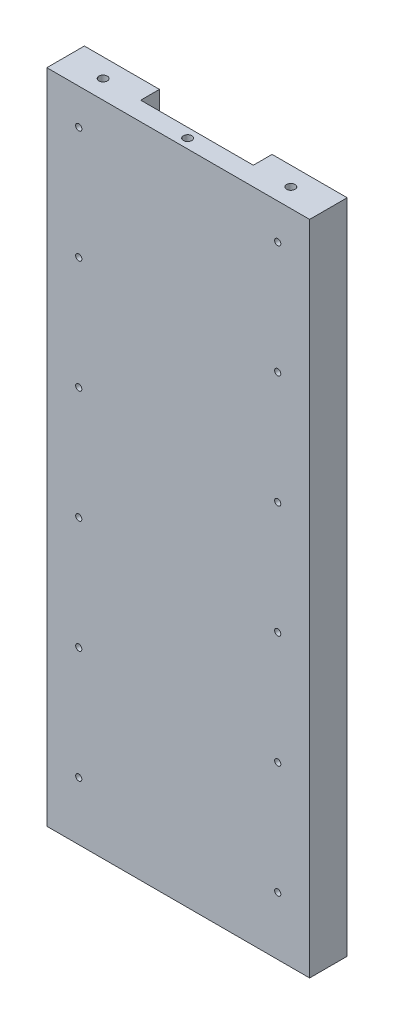
ISO-10303-21;
HEADER;
FILE_DESCRIPTION(('STEP AP214'),'2;1');
FILE_NAME('part.step','',(''),(''),'','','');
FILE_SCHEMA(('AUTOMOTIVE_DESIGN { 1 0 10303 214 1 1 1 1 }'));
ENDSEC;
DATA;
#1=APPLICATION_CONTEXT('core data for automotive mechanical design processes');
#2=APPLICATION_PROTOCOL_DEFINITION('international standard','automotive_design',2000,#1);
#3=PRODUCT_CONTEXT('',#1,'mechanical');
#4=PRODUCT('Part','Part','',(#3));
#5=PRODUCT_RELATED_PRODUCT_CATEGORY('part','',(#4));
#6=PRODUCT_DEFINITION_FORMATION('','',#4);
#7=PRODUCT_DEFINITION_CONTEXT('part definition',#1,'design');
#8=PRODUCT_DEFINITION('design','',#6,#7);
#9=PRODUCT_DEFINITION_SHAPE('','',#8);
#10=(LENGTH_UNIT() NAMED_UNIT(*) SI_UNIT(.MILLI.,.METRE.));
#11=(NAMED_UNIT(*) PLANE_ANGLE_UNIT() SI_UNIT($,.RADIAN.));
#12=(NAMED_UNIT(*) SI_UNIT($,.STERADIAN.) SOLID_ANGLE_UNIT());
#13=UNCERTAINTY_MEASURE_WITH_UNIT(LENGTH_MEASURE(1.E-05),#10,'distance_accuracy_value','');
#14=(GEOMETRIC_REPRESENTATION_CONTEXT(3) GLOBAL_UNCERTAINTY_ASSIGNED_CONTEXT((#13)) GLOBAL_UNIT_ASSIGNED_CONTEXT((#10,
#11,#12)) REPRESENTATION_CONTEXT('',''));
#15=CARTESIAN_POINT('',(0.,0.,0.));
#16=DIRECTION('',(0.,0.,1.));
#17=DIRECTION('',(1.,0.,0.));
#18=AXIS2_PLACEMENT_3D('',#15,#16,#17);
#19=CARTESIAN_POINT('',(0.,350.,0.));
#20=DIRECTION('',(0.,0.,-1.));
#21=DIRECTION('',(-1.,0.,0.));
#22=AXIS2_PLACEMENT_3D('',#19,#20,#21);
#23=PLANE('',#22);
#24=CARTESIAN_POINT('',(17.,91.,0.));
#25=DIRECTION('',(0.,0.,-1.));
#26=DIRECTION('',(-1.,0.,0.));
#27=AXIS2_PLACEMENT_3D('',#24,#25,#26);
#28=CIRCLE('',#27,1.65);
#29=CARTESIAN_POINT('',(15.35,91.,0.));
#30=VERTEX_POINT('',#29);
#31=EDGE_CURVE('E246',#30,#30,#28,.T.);
#32=ORIENTED_EDGE('',*,*,#31,.F.);
#33=EDGE_LOOP('',(#32));
#34=FACE_BOUND('',#33,.T.);
#35=CARTESIAN_POINT('',(17.,151.,0.));
#36=DIRECTION('',(0.,0.,-1.));
#37=DIRECTION('',(-1.,0.,0.));
#38=AXIS2_PLACEMENT_3D('',#35,#36,#37);
#39=CIRCLE('',#38,1.65);
#40=CARTESIAN_POINT('',(15.35,151.,0.));
#41=VERTEX_POINT('',#40);
#42=EDGE_CURVE('E240',#41,#41,#39,.T.);
#43=ORIENTED_EDGE('',*,*,#42,.F.);
#44=EDGE_LOOP('',(#43));
#45=FACE_BOUND('',#44,.T.);
#46=CARTESIAN_POINT('',(17.,211.,0.));
#47=DIRECTION('',(0.,0.,-1.));
#48=DIRECTION('',(-1.,0.,0.));
#49=AXIS2_PLACEMENT_3D('',#46,#47,#48);
#50=CIRCLE('',#49,1.65);
#51=CARTESIAN_POINT('',(15.35,211.,0.));
#52=VERTEX_POINT('',#51);
#53=EDGE_CURVE('E234',#52,#52,#50,.T.);
#54=ORIENTED_EDGE('',*,*,#53,.F.);
#55=EDGE_LOOP('',(#54));
#56=FACE_BOUND('',#55,.T.);
#57=CARTESIAN_POINT('',(17.,271.,0.));
#58=DIRECTION('',(0.,0.,-1.));
#59=DIRECTION('',(-1.,0.,0.));
#60=AXIS2_PLACEMENT_3D('',#57,#58,#59);
#61=CIRCLE('',#60,1.65);
#62=CARTESIAN_POINT('',(15.35,271.,0.));
#63=VERTEX_POINT('',#62);
#64=EDGE_CURVE('E228',#63,#63,#61,.T.);
#65=ORIENTED_EDGE('',*,*,#64,.F.);
#66=EDGE_LOOP('',(#65));
#67=FACE_BOUND('',#66,.T.);
#68=CARTESIAN_POINT('',(17.,31.,0.));
#69=DIRECTION('',(0.,0.,-1.));
#70=DIRECTION('',(-1.,0.,0.));
#71=AXIS2_PLACEMENT_3D('',#68,#69,#70);
#72=CIRCLE('',#71,1.65);
#73=CARTESIAN_POINT('',(15.35,31.,0.));
#74=VERTEX_POINT('',#73);
#75=EDGE_CURVE('E216',#74,#74,#72,.T.);
#76=ORIENTED_EDGE('',*,*,#75,.F.);
#77=EDGE_LOOP('',(#76));
#78=FACE_BOUND('',#77,.T.);
#79=CARTESIAN_POINT('',(17.,331.,0.));
#80=DIRECTION('',(0.,0.,-1.));
#81=DIRECTION('',(-1.,0.,0.));
#82=AXIS2_PLACEMENT_3D('',#79,#80,#81);
#83=CIRCLE('',#82,1.65000000000001);
#84=CARTESIAN_POINT('',(15.35,331.,0.));
#85=VERTEX_POINT('',#84);
#86=EDGE_CURVE('E210',#85,#85,#83,.T.);
#87=ORIENTED_EDGE('',*,*,#86,.F.);
#88=EDGE_LOOP('',(#87));
#89=FACE_BOUND('',#88,.T.);
#90=DIRECTION('',(0.,1.,0.));
#91=VECTOR('',#90,1.);
#92=CARTESIAN_POINT('',(40.,350.,0.));
#93=LINE('',#92,#91);
#94=CARTESIAN_POINT('',(40.,0.,0.));
#95=VERTEX_POINT('',#94);
#96=CARTESIAN_POINT('',(40.,350.,0.));
#97=VERTEX_POINT('',#96);
#98=EDGE_CURVE('E101',#95,#97,#93,.T.);
#99=ORIENTED_EDGE('',*,*,#98,.F.);
#100=DIRECTION('',(1.,0.,0.));
#101=VECTOR('',#100,1.);
#102=CARTESIAN_POINT('',(0.,0.,0.));
#103=LINE('',#102,#101);
#104=CARTESIAN_POINT('',(0.,0.,0.));
#105=VERTEX_POINT('',#104);
#106=EDGE_CURVE('E119',#105,#95,#103,.T.);
#107=ORIENTED_EDGE('',*,*,#106,.F.);
#108=DIRECTION('',(0.,-1.,0.));
#109=VECTOR('',#108,1.);
#110=CARTESIAN_POINT('',(0.,0.,0.));
#111=LINE('',#110,#109);
#112=CARTESIAN_POINT('',(0.,350.,0.));
#113=VERTEX_POINT('',#112);
#114=EDGE_CURVE('E120',#113,#105,#111,.T.);
#115=ORIENTED_EDGE('',*,*,#114,.F.);
#116=DIRECTION('',(-1.,0.,0.));
#117=VECTOR('',#116,1.);
#118=CARTESIAN_POINT('',(0.,350.,0.));
#119=LINE('',#118,#117);
#120=EDGE_CURVE('E128',#97,#113,#119,.T.);
#121=ORIENTED_EDGE('',*,*,#120,.F.);
#122=EDGE_LOOP('',(#99,#107,#115,#121));
#123=FACE_BOUND('',#122,.T.);
#124=ADVANCED_FACE('F29',(#34,#45,#56,#67,#78,#89,#123),#23,.T.);
#125=CARTESIAN_POINT('',(0.,0.,20.));
#126=DIRECTION('',(1.,0.,0.));
#127=DIRECTION('',(0.,0.,-1.));
#128=AXIS2_PLACEMENT_3D('',#125,#126,#127);
#129=PLANE('',#128);
#130=ORIENTED_EDGE('',*,*,#114,.T.);
#131=DIRECTION('',(0.,0.,-1.));
#132=VECTOR('',#131,1.);
#133=CARTESIAN_POINT('',(0.,0.,20.));
#134=LINE('',#133,#132);
#135=CARTESIAN_POINT('',(0.,0.,20.));
#136=VERTEX_POINT('',#135);
#137=EDGE_CURVE('E11',#136,#105,#134,.T.);
#138=ORIENTED_EDGE('',*,*,#137,.F.);
#139=DIRECTION('',(0.,-1.,0.));
#140=VECTOR('',#139,1.);
#141=CARTESIAN_POINT('',(0.,0.,20.));
#142=LINE('',#141,#140);
#143=CARTESIAN_POINT('',(0.,350.,20.));
#144=VERTEX_POINT('',#143);
#145=EDGE_CURVE('E131',#144,#136,#142,.T.);
#146=ORIENTED_EDGE('',*,*,#145,.F.);
#147=DIRECTION('',(0.,0.,-1.));
#148=VECTOR('',#147,1.);
#149=CARTESIAN_POINT('',(0.,350.,20.));
#150=LINE('',#149,#148);
#151=EDGE_CURVE('E138',#144,#113,#150,.T.);
#152=ORIENTED_EDGE('',*,*,#151,.T.);
#153=EDGE_LOOP('',(#130,#138,#146,#152));
#154=FACE_BOUND('',#153,.T.);
#155=ADVANCED_FACE('F31',(#154),#129,.F.);
#156=CARTESIAN_POINT('',(0.,0.,20.));
#157=DIRECTION('',(0.,1.,0.));
#158=DIRECTION('',(0.,0.,1.));
#159=AXIS2_PLACEMENT_3D('',#156,#157,#158);
#160=PLANE('',#159);
#161=CARTESIAN_POINT('',(120.,0.,10.));
#162=DIRECTION('',(0.,-1.,0.));
#163=DIRECTION('',(0.,0.,-1.));
#164=AXIS2_PLACEMENT_3D('',#161,#162,#163);
#165=CIRCLE('',#164,2.25);
#166=CARTESIAN_POINT('',(120.,0.,7.75000000000001));
#167=VERTEX_POINT('',#166);
#168=EDGE_CURVE('E198',#167,#167,#165,.T.);
#169=ORIENTED_EDGE('',*,*,#168,.F.);
#170=EDGE_LOOP('',(#169));
#171=FACE_BOUND('',#170,.T.);
#172=CARTESIAN_POINT('',(20.,0.,9.99999999999999));
#173=DIRECTION('',(0.,-1.,0.));
#174=DIRECTION('',(0.,0.,-1.));
#175=AXIS2_PLACEMENT_3D('',#172,#173,#174);
#176=CIRCLE('',#175,2.25);
#177=CARTESIAN_POINT('',(20.,0.,7.74999999999999));
#178=VERTEX_POINT('',#177);
#179=EDGE_CURVE('E192',#178,#178,#176,.T.);
#180=ORIENTED_EDGE('',*,*,#179,.F.);
#181=EDGE_LOOP('',(#180));
#182=FACE_BOUND('',#181,.T.);
#183=ORIENTED_EDGE('',*,*,#106,.T.);
#184=DIRECTION('',(0.,0.,-1.));
#185=VECTOR('',#184,1.);
#186=CARTESIAN_POINT('',(40.,0.,10.));
#187=LINE('',#186,#185);
#188=CARTESIAN_POINT('',(40.,0.,10.));
#189=VERTEX_POINT('',#188);
#190=EDGE_CURVE('E114',#189,#95,#187,.T.);
#191=ORIENTED_EDGE('',*,*,#190,.F.);
#192=DIRECTION('',(-1.,0.,0.));
#193=VECTOR('',#192,1.);
#194=CARTESIAN_POINT('',(40.,0.,10.));
#195=LINE('',#194,#193);
#196=CARTESIAN_POINT('',(100.,0.,10.));
#197=VERTEX_POINT('',#196);
#198=EDGE_CURVE('E113',#197,#189,#195,.T.);
#199=ORIENTED_EDGE('',*,*,#198,.F.);
#200=DIRECTION('',(0.,0.,-1.));
#201=VECTOR('',#200,1.);
#202=CARTESIAN_POINT('',(100.,0.,10.));
#203=LINE('',#202,#201);
#204=CARTESIAN_POINT('',(100.,0.,0.));
#205=VERTEX_POINT('',#204);
#206=EDGE_CURVE('E95',#197,#205,#203,.T.);
#207=ORIENTED_EDGE('',*,*,#206,.T.);
#208=CARTESIAN_POINT('',(140.,0.,0.));
#209=VERTEX_POINT('',#208);
#210=EDGE_CURVE('E109',#205,#209,#103,.T.);
#211=ORIENTED_EDGE('',*,*,#210,.T.);
#212=DIRECTION('',(0.,0.,-1.));
#213=VECTOR('',#212,1.);
#214=CARTESIAN_POINT('',(140.,0.,20.));
#215=LINE('',#214,#213);
#216=CARTESIAN_POINT('',(140.,0.,20.));
#217=VERTEX_POINT('',#216);
#218=EDGE_CURVE('E37',#217,#209,#215,.T.);
#219=ORIENTED_EDGE('',*,*,#218,.F.);
#220=DIRECTION('',(1.,0.,0.));
#221=VECTOR('',#220,1.);
#222=CARTESIAN_POINT('',(0.,0.,20.));
#223=LINE('',#222,#221);
#224=EDGE_CURVE('E133',#136,#217,#223,.T.);
#225=ORIENTED_EDGE('',*,*,#224,.F.);
#226=ORIENTED_EDGE('',*,*,#137,.T.);
#227=EDGE_LOOP('',(#183,#191,#199,#207,#211,#219,#225,#226));
#228=FACE_BOUND('',#227,.T.);
#229=ADVANCED_FACE('F107',(#171,#182,#228),#160,.F.);
#230=CARTESIAN_POINT('',(140.,0.,20.));
#231=DIRECTION('',(-1.,0.,0.));
#232=DIRECTION('',(0.,0.,1.));
#233=AXIS2_PLACEMENT_3D('',#230,#231,#232);
#234=PLANE('',#233);
#235=DIRECTION('',(0.,1.,0.));
#236=VECTOR('',#235,1.);
#237=CARTESIAN_POINT('',(140.,0.,0.));
#238=LINE('',#237,#236);
#239=CARTESIAN_POINT('',(140.,350.,0.));
#240=VERTEX_POINT('',#239);
#241=EDGE_CURVE('E118',#209,#240,#238,.T.);
#242=ORIENTED_EDGE('',*,*,#241,.T.);
#243=DIRECTION('',(0.,0.,-1.));
#244=VECTOR('',#243,1.);
#245=CARTESIAN_POINT('',(140.,350.,20.));
#246=LINE('',#245,#244);
#247=CARTESIAN_POINT('',(140.,350.,20.));
#248=VERTEX_POINT('',#247);
#249=EDGE_CURVE('E141',#248,#240,#246,.T.);
#250=ORIENTED_EDGE('',*,*,#249,.F.);
#251=DIRECTION('',(0.,1.,0.));
#252=VECTOR('',#251,1.);
#253=CARTESIAN_POINT('',(140.,0.,20.));
#254=LINE('',#253,#252);
#255=EDGE_CURVE('E135',#217,#248,#254,.T.);
#256=ORIENTED_EDGE('',*,*,#255,.F.);
#257=ORIENTED_EDGE('',*,*,#218,.T.);
#258=EDGE_LOOP('',(#242,#250,#256,#257));
#259=FACE_BOUND('',#258,.T.);
#260=ADVANCED_FACE('F145',(#259),#234,.F.);
#261=CARTESIAN_POINT('',(0.,350.,20.));
#262=DIRECTION('',(0.,-1.,0.));
#263=DIRECTION('',(0.,0.,-1.));
#264=AXIS2_PLACEMENT_3D('',#261,#262,#263);
#265=PLANE('',#264);
#266=CARTESIAN_POINT('',(120.,350.,9.99999999999999));
#267=DIRECTION('',(0.,1.,0.));
#268=DIRECTION('',(0.,0.,1.));
#269=AXIS2_PLACEMENT_3D('',#266,#267,#268);
#270=CIRCLE('',#269,2.25);
#271=CARTESIAN_POINT('',(120.,350.,12.25));
#272=VERTEX_POINT('',#271);
#273=EDGE_CURVE('E186',#272,#272,#270,.T.);
#274=ORIENTED_EDGE('',*,*,#273,.F.);
#275=EDGE_LOOP('',(#274));
#276=FACE_BOUND('',#275,.T.);
#277=CARTESIAN_POINT('',(70.,350.,15.0000000000075));
#278=DIRECTION('',(0.,1.,0.));
#279=DIRECTION('',(0.,0.,1.));
#280=AXIS2_PLACEMENT_3D('',#277,#278,#279);
#281=CIRCLE('',#280,2.25);
#282=CARTESIAN_POINT('',(70.,350.,17.2500000000074));
#283=VERTEX_POINT('',#282);
#284=EDGE_CURVE('E180',#283,#283,#281,.T.);
#285=ORIENTED_EDGE('',*,*,#284,.F.);
#286=EDGE_LOOP('',(#285));
#287=FACE_BOUND('',#286,.T.);
#288=CARTESIAN_POINT('',(20.,350.,10.));
#289=DIRECTION('',(0.,1.,0.));
#290=DIRECTION('',(0.,0.,1.));
#291=AXIS2_PLACEMENT_3D('',#288,#289,#290);
#292=CIRCLE('',#291,2.25);
#293=CARTESIAN_POINT('',(20.,350.,12.25));
#294=VERTEX_POINT('',#293);
#295=EDGE_CURVE('E174',#294,#294,#292,.T.);
#296=ORIENTED_EDGE('',*,*,#295,.F.);
#297=EDGE_LOOP('',(#296));
#298=FACE_BOUND('',#297,.T.);
#299=DIRECTION('',(1.,0.,0.));
#300=VECTOR('',#299,1.);
#301=CARTESIAN_POINT('',(100.,350.,10.));
#302=LINE('',#301,#300);
#303=CARTESIAN_POINT('',(40.,350.,10.));
#304=VERTEX_POINT('',#303);
#305=CARTESIAN_POINT('',(100.,350.,10.));
#306=VERTEX_POINT('',#305);
#307=EDGE_CURVE('E169',#304,#306,#302,.T.);
#308=ORIENTED_EDGE('',*,*,#307,.F.);
#309=DIRECTION('',(0.,0.,-1.));
#310=VECTOR('',#309,1.);
#311=CARTESIAN_POINT('',(40.,350.,10.));
#312=LINE('',#311,#310);
#313=EDGE_CURVE('E123',#304,#97,#312,.T.);
#314=ORIENTED_EDGE('',*,*,#313,.T.);
#315=ORIENTED_EDGE('',*,*,#120,.T.);
#316=ORIENTED_EDGE('',*,*,#151,.F.);
#317=DIRECTION('',(-1.,0.,0.));
#318=VECTOR('',#317,1.);
#319=CARTESIAN_POINT('',(0.,350.,20.));
#320=LINE('',#319,#318);
#321=EDGE_CURVE('E52',#248,#144,#320,.T.);
#322=ORIENTED_EDGE('',*,*,#321,.F.);
#323=ORIENTED_EDGE('',*,*,#249,.T.);
#324=CARTESIAN_POINT('',(100.,350.,0.));
#325=VERTEX_POINT('',#324);
#326=EDGE_CURVE('E129',#240,#325,#119,.T.);
#327=ORIENTED_EDGE('',*,*,#326,.T.);
#328=DIRECTION('',(0.,0.,-1.));
#329=VECTOR('',#328,1.);
#330=CARTESIAN_POINT('',(100.,350.,10.));
#331=LINE('',#330,#329);
#332=EDGE_CURVE('E44',#306,#325,#331,.T.);
#333=ORIENTED_EDGE('',*,*,#332,.F.);
#334=EDGE_LOOP('',(#308,#314,#315,#316,#322,#323,#327,#333));
#335=FACE_BOUND('',#334,.T.);
#336=ADVANCED_FACE('F319',(#276,#287,#298,#335),#265,.F.);
#337=CARTESIAN_POINT('',(0.,350.,20.));
#338=DIRECTION('',(0.,0.,-1.));
#339=DIRECTION('',(-1.,0.,0.));
#340=AXIS2_PLACEMENT_3D('',#337,#338,#339);
#341=PLANE('',#340);
#342=CARTESIAN_POINT('',(123.,271.,20.));
#343=DIRECTION('',(0.,0.,-1.));
#344=DIRECTION('',(-1.,0.,0.));
#345=AXIS2_PLACEMENT_3D('',#342,#343,#344);
#346=CIRCLE('',#345,1.65000000000001);
#347=CARTESIAN_POINT('',(121.35,271.,20.));
#348=VERTEX_POINT('',#347);
#349=EDGE_CURVE('E267',#348,#348,#346,.T.);
#350=ORIENTED_EDGE('',*,*,#349,.T.);
#351=EDGE_LOOP('',(#350));
#352=FACE_BOUND('',#351,.T.);
#353=CARTESIAN_POINT('',(123.,211.,20.));
#354=DIRECTION('',(0.,0.,-1.));
#355=DIRECTION('',(-1.,0.,0.));
#356=AXIS2_PLACEMENT_3D('',#353,#354,#355);
#357=CIRCLE('',#356,1.65000000000001);
#358=CARTESIAN_POINT('',(121.35,211.,20.));
#359=VERTEX_POINT('',#358);
#360=EDGE_CURVE('E261',#359,#359,#357,.T.);
#361=ORIENTED_EDGE('',*,*,#360,.T.);
#362=EDGE_LOOP('',(#361));
#363=FACE_BOUND('',#362,.T.);
#364=CARTESIAN_POINT('',(123.,151.,20.));
#365=DIRECTION('',(0.,0.,-1.));
#366=DIRECTION('',(-1.,0.,0.));
#367=AXIS2_PLACEMENT_3D('',#364,#365,#366);
#368=CIRCLE('',#367,1.65000000000001);
#369=CARTESIAN_POINT('',(121.35,151.,20.));
#370=VERTEX_POINT('',#369);
#371=EDGE_CURVE('E255',#370,#370,#368,.T.);
#372=ORIENTED_EDGE('',*,*,#371,.T.);
#373=EDGE_LOOP('',(#372));
#374=FACE_BOUND('',#373,.T.);
#375=CARTESIAN_POINT('',(123.,91.,20.));
#376=DIRECTION('',(0.,0.,-1.));
#377=DIRECTION('',(-1.,0.,0.));
#378=AXIS2_PLACEMENT_3D('',#375,#376,#377);
#379=CIRCLE('',#378,1.65);
#380=CARTESIAN_POINT('',(121.35,91.,20.));
#381=VERTEX_POINT('',#380);
#382=EDGE_CURVE('E249',#381,#381,#379,.T.);
#383=ORIENTED_EDGE('',*,*,#382,.T.);
#384=EDGE_LOOP('',(#383));
#385=FACE_BOUND('',#384,.T.);
#386=CARTESIAN_POINT('',(17.,91.,20.));
#387=DIRECTION('',(0.,0.,-1.));
#388=DIRECTION('',(-1.,0.,0.));
#389=AXIS2_PLACEMENT_3D('',#386,#387,#388);
#390=CIRCLE('',#389,1.65);
#391=CARTESIAN_POINT('',(15.35,91.,20.));
#392=VERTEX_POINT('',#391);
#393=EDGE_CURVE('E243',#392,#392,#390,.T.);
#394=ORIENTED_EDGE('',*,*,#393,.T.);
#395=EDGE_LOOP('',(#394));
#396=FACE_BOUND('',#395,.T.);
#397=CARTESIAN_POINT('',(17.,151.,20.));
#398=DIRECTION('',(0.,0.,-1.));
#399=DIRECTION('',(-1.,0.,0.));
#400=AXIS2_PLACEMENT_3D('',#397,#398,#399);
#401=CIRCLE('',#400,1.65);
#402=CARTESIAN_POINT('',(15.35,151.,20.));
#403=VERTEX_POINT('',#402);
#404=EDGE_CURVE('E237',#403,#403,#401,.T.);
#405=ORIENTED_EDGE('',*,*,#404,.T.);
#406=EDGE_LOOP('',(#405));
#407=FACE_BOUND('',#406,.T.);
#408=CARTESIAN_POINT('',(17.,211.,20.));
#409=DIRECTION('',(0.,0.,-1.));
#410=DIRECTION('',(-1.,0.,0.));
#411=AXIS2_PLACEMENT_3D('',#408,#409,#410);
#412=CIRCLE('',#411,1.65);
#413=CARTESIAN_POINT('',(15.35,211.,20.));
#414=VERTEX_POINT('',#413);
#415=EDGE_CURVE('E231',#414,#414,#412,.T.);
#416=ORIENTED_EDGE('',*,*,#415,.T.);
#417=EDGE_LOOP('',(#416));
#418=FACE_BOUND('',#417,.T.);
#419=CARTESIAN_POINT('',(17.,271.,20.));
#420=DIRECTION('',(0.,0.,-1.));
#421=DIRECTION('',(-1.,0.,0.));
#422=AXIS2_PLACEMENT_3D('',#419,#420,#421);
#423=CIRCLE('',#422,1.65);
#424=CARTESIAN_POINT('',(15.35,271.,20.));
#425=VERTEX_POINT('',#424);
#426=EDGE_CURVE('E225',#425,#425,#423,.T.);
#427=ORIENTED_EDGE('',*,*,#426,.T.);
#428=EDGE_LOOP('',(#427));
#429=FACE_BOUND('',#428,.T.);
#430=CARTESIAN_POINT('',(123.,31.,20.));
#431=DIRECTION('',(0.,0.,-1.));
#432=DIRECTION('',(-1.,0.,0.));
#433=AXIS2_PLACEMENT_3D('',#430,#431,#432);
#434=CIRCLE('',#433,1.65);
#435=CARTESIAN_POINT('',(121.35,31.,20.));
#436=VERTEX_POINT('',#435);
#437=EDGE_CURVE('E219',#436,#436,#434,.T.);
#438=ORIENTED_EDGE('',*,*,#437,.T.);
#439=EDGE_LOOP('',(#438));
#440=FACE_BOUND('',#439,.T.);
#441=CARTESIAN_POINT('',(17.,31.,20.));
#442=DIRECTION('',(0.,0.,-1.));
#443=DIRECTION('',(-1.,0.,0.));
#444=AXIS2_PLACEMENT_3D('',#441,#442,#443);
#445=CIRCLE('',#444,1.65);
#446=CARTESIAN_POINT('',(15.35,31.,20.));
#447=VERTEX_POINT('',#446);
#448=EDGE_CURVE('E213',#447,#447,#445,.T.);
#449=ORIENTED_EDGE('',*,*,#448,.T.);
#450=EDGE_LOOP('',(#449));
#451=FACE_BOUND('',#450,.T.);
#452=CARTESIAN_POINT('',(17.,331.,20.));
#453=DIRECTION('',(0.,0.,-1.));
#454=DIRECTION('',(-1.,0.,0.));
#455=AXIS2_PLACEMENT_3D('',#452,#453,#454);
#456=CIRCLE('',#455,1.65000000000001);
#457=CARTESIAN_POINT('',(15.35,331.,20.));
#458=VERTEX_POINT('',#457);
#459=EDGE_CURVE('E207',#458,#458,#456,.T.);
#460=ORIENTED_EDGE('',*,*,#459,.T.);
#461=EDGE_LOOP('',(#460));
#462=FACE_BOUND('',#461,.T.);
#463=CARTESIAN_POINT('',(123.,331.,20.));
#464=DIRECTION('',(0.,0.,-1.));
#465=DIRECTION('',(-1.,0.,0.));
#466=AXIS2_PLACEMENT_3D('',#463,#464,#465);
#467=CIRCLE('',#466,1.65000000000002);
#468=CARTESIAN_POINT('',(121.35,331.,20.));
#469=VERTEX_POINT('',#468);
#470=EDGE_CURVE('E201',#469,#469,#467,.T.);
#471=ORIENTED_EDGE('',*,*,#470,.T.);
#472=EDGE_LOOP('',(#471));
#473=FACE_BOUND('',#472,.T.);
#474=ORIENTED_EDGE('',*,*,#145,.T.);
#475=ORIENTED_EDGE('',*,*,#224,.T.);
#476=ORIENTED_EDGE('',*,*,#255,.T.);
#477=ORIENTED_EDGE('',*,*,#321,.T.);
#478=EDGE_LOOP('',(#474,#475,#476,#477));
#479=FACE_BOUND('',#478,.T.);
#480=ADVANCED_FACE('F149',(#352,#363,#374,#385,#396,#407,#418,#429,#440,#451,#462,#473,#479),
#341,.F.);
#481=CARTESIAN_POINT('',(123.,271.,0.));
#482=DIRECTION('',(0.,0.,-1.));
#483=DIRECTION('',(-1.,0.,0.));
#484=AXIS2_PLACEMENT_3D('',#481,#482,#483);
#485=CIRCLE('',#484,1.65000000000001);
#486=CARTESIAN_POINT('',(121.35,271.,0.));
#487=VERTEX_POINT('',#486);
#488=EDGE_CURVE('E270',#487,#487,#485,.T.);
#489=ORIENTED_EDGE('',*,*,#488,.F.);
#490=EDGE_LOOP('',(#489));
#491=FACE_BOUND('',#490,.T.);
#492=CARTESIAN_POINT('',(123.,211.,0.));
#493=DIRECTION('',(0.,0.,-1.));
#494=DIRECTION('',(-1.,0.,0.));
#495=AXIS2_PLACEMENT_3D('',#492,#493,#494);
#496=CIRCLE('',#495,1.65000000000001);
#497=CARTESIAN_POINT('',(121.35,211.,0.));
#498=VERTEX_POINT('',#497);
#499=EDGE_CURVE('E264',#498,#498,#496,.T.);
#500=ORIENTED_EDGE('',*,*,#499,.F.);
#501=EDGE_LOOP('',(#500));
#502=FACE_BOUND('',#501,.T.);
#503=CARTESIAN_POINT('',(123.,151.,0.));
#504=DIRECTION('',(0.,0.,-1.));
#505=DIRECTION('',(-1.,0.,0.));
#506=AXIS2_PLACEMENT_3D('',#503,#504,#505);
#507=CIRCLE('',#506,1.65000000000001);
#508=CARTESIAN_POINT('',(121.35,151.,0.));
#509=VERTEX_POINT('',#508);
#510=EDGE_CURVE('E258',#509,#509,#507,.T.);
#511=ORIENTED_EDGE('',*,*,#510,.F.);
#512=EDGE_LOOP('',(#511));
#513=FACE_BOUND('',#512,.T.);
#514=CARTESIAN_POINT('',(123.,91.,0.));
#515=DIRECTION('',(0.,0.,-1.));
#516=DIRECTION('',(-1.,0.,0.));
#517=AXIS2_PLACEMENT_3D('',#514,#515,#516);
#518=CIRCLE('',#517,1.65);
#519=CARTESIAN_POINT('',(121.35,91.,0.));
#520=VERTEX_POINT('',#519);
#521=EDGE_CURVE('E252',#520,#520,#518,.T.);
#522=ORIENTED_EDGE('',*,*,#521,.F.);
#523=EDGE_LOOP('',(#522));
#524=FACE_BOUND('',#523,.T.);
#525=CARTESIAN_POINT('',(123.,31.,0.));
#526=DIRECTION('',(0.,0.,-1.));
#527=DIRECTION('',(-1.,0.,0.));
#528=AXIS2_PLACEMENT_3D('',#525,#526,#527);
#529=CIRCLE('',#528,1.65);
#530=CARTESIAN_POINT('',(121.35,31.,0.));
#531=VERTEX_POINT('',#530);
#532=EDGE_CURVE('E222',#531,#531,#529,.T.);
#533=ORIENTED_EDGE('',*,*,#532,.F.);
#534=EDGE_LOOP('',(#533));
#535=FACE_BOUND('',#534,.T.);
#536=CARTESIAN_POINT('',(123.,331.,0.));
#537=DIRECTION('',(0.,0.,-1.));
#538=DIRECTION('',(-1.,0.,0.));
#539=AXIS2_PLACEMENT_3D('',#536,#537,#538);
#540=CIRCLE('',#539,1.65000000000002);
#541=CARTESIAN_POINT('',(121.35,331.,0.));
#542=VERTEX_POINT('',#541);
#543=EDGE_CURVE('E204',#542,#542,#540,.T.);
#544=ORIENTED_EDGE('',*,*,#543,.F.);
#545=EDGE_LOOP('',(#544));
#546=FACE_BOUND('',#545,.T.);
#547=DIRECTION('',(0.,-1.,0.));
#548=VECTOR('',#547,1.);
#549=CARTESIAN_POINT('',(100.,0.,0.));
#550=LINE('',#549,#548);
#551=EDGE_CURVE('E92',#325,#205,#550,.T.);
#552=ORIENTED_EDGE('',*,*,#551,.F.);
#553=ORIENTED_EDGE('',*,*,#326,.F.);
#554=ORIENTED_EDGE('',*,*,#241,.F.);
#555=ORIENTED_EDGE('',*,*,#210,.F.);
#556=EDGE_LOOP('',(#552,#553,#554,#555));
#557=FACE_BOUND('',#556,.T.);
#558=ADVANCED_FACE('F117',(#491,#502,#513,#524,#535,#546,#557),#23,.T.);
#559=CARTESIAN_POINT('',(40.,350.,10.));
#560=DIRECTION('',(-1.,0.,0.));
#561=DIRECTION('',(0.,0.,1.));
#562=AXIS2_PLACEMENT_3D('',#559,#560,#561);
#563=PLANE('',#562);
#564=ORIENTED_EDGE('',*,*,#98,.T.);
#565=ORIENTED_EDGE('',*,*,#313,.F.);
#566=DIRECTION('',(0.,1.,0.));
#567=VECTOR('',#566,1.);
#568=CARTESIAN_POINT('',(40.,350.,10.));
#569=LINE('',#568,#567);
#570=EDGE_CURVE('E160',#189,#304,#569,.T.);
#571=ORIENTED_EDGE('',*,*,#570,.F.);
#572=ORIENTED_EDGE('',*,*,#190,.T.);
#573=EDGE_LOOP('',(#564,#565,#571,#572));
#574=FACE_BOUND('',#573,.T.);
#575=ADVANCED_FACE('F278',(#574),#563,.F.);
#576=CARTESIAN_POINT('',(100.,0.,10.));
#577=DIRECTION('',(1.,0.,0.));
#578=DIRECTION('',(0.,0.,-1.));
#579=AXIS2_PLACEMENT_3D('',#576,#577,#578);
#580=PLANE('',#579);
#581=ORIENTED_EDGE('',*,*,#551,.T.);
#582=ORIENTED_EDGE('',*,*,#206,.F.);
#583=DIRECTION('',(0.,-1.,0.));
#584=VECTOR('',#583,1.);
#585=CARTESIAN_POINT('',(100.,0.,10.));
#586=LINE('',#585,#584);
#587=EDGE_CURVE('E165',#306,#197,#586,.T.);
#588=ORIENTED_EDGE('',*,*,#587,.F.);
#589=ORIENTED_EDGE('',*,*,#332,.T.);
#590=EDGE_LOOP('',(#581,#582,#588,#589));
#591=FACE_BOUND('',#590,.T.);
#592=ADVANCED_FACE('F94',(#591),#580,.F.);
#593=CARTESIAN_POINT('',(40.,350.,10.));
#594=DIRECTION('',(0.,0.,1.));
#595=DIRECTION('',(1.,0.,0.));
#596=AXIS2_PLACEMENT_3D('',#593,#594,#595);
#597=PLANE('',#596);
#598=ORIENTED_EDGE('',*,*,#307,.T.);
#599=ORIENTED_EDGE('',*,*,#587,.T.);
#600=ORIENTED_EDGE('',*,*,#198,.T.);
#601=ORIENTED_EDGE('',*,*,#570,.T.);
#602=EDGE_LOOP('',(#598,#599,#600,#601));
#603=FACE_BOUND('',#602,.T.);
#604=ADVANCED_FACE('F369',(#603),#597,.F.);
#605=CARTESIAN_POINT('',(20.,335.,10.));
#606=DIRECTION('',(0.,1.,0.));
#607=DIRECTION('',(0.,0.,1.));
#608=AXIS2_PLACEMENT_3D('',#605,#606,#607);
#609=CYLINDRICAL_SURFACE('',#608,2.25);
#610=CARTESIAN_POINT('',(20.,335.,10.));
#611=DIRECTION('',(0.,1.,0.));
#612=DIRECTION('',(0.,0.,1.));
#613=AXIS2_PLACEMENT_3D('',#610,#611,#612);
#614=CIRCLE('',#613,2.25);
#615=CARTESIAN_POINT('',(20.,335.,12.25));
#616=VERTEX_POINT('',#615);
#617=EDGE_CURVE('E102',#616,#616,#614,.T.);
#618=ORIENTED_EDGE('',*,*,#617,.F.);
#619=EDGE_LOOP('',(#618));
#620=FACE_BOUND('',#619,.T.);
#621=ORIENTED_EDGE('',*,*,#295,.T.);
#622=EDGE_LOOP('',(#621));
#623=FACE_BOUND('',#622,.T.);
#624=ADVANCED_FACE('F365',(#620,#623),#609,.F.);
#625=CARTESIAN_POINT('',(20.,335.,10.));
#626=DIRECTION('',(0.,1.,0.));
#627=DIRECTION('',(0.,0.,1.));
#628=AXIS2_PLACEMENT_3D('',#625,#626,#627);
#629=PLANE('',#628);
#630=ORIENTED_EDGE('',*,*,#617,.T.);
#631=EDGE_LOOP('',(#630));
#632=FACE_BOUND('',#631,.T.);
#633=ADVANCED_FACE('F361',(#632),#629,.T.);
#634=CARTESIAN_POINT('',(70.,335.,15.0000000000075));
#635=DIRECTION('',(0.,1.,0.));
#636=DIRECTION('',(0.,0.,1.));
#637=AXIS2_PLACEMENT_3D('',#634,#635,#636);
#638=CYLINDRICAL_SURFACE('',#637,2.25);
#639=CARTESIAN_POINT('',(70.,335.,15.0000000000075));
#640=DIRECTION('',(0.,1.,0.));
#641=DIRECTION('',(0.,0.,1.));
#642=AXIS2_PLACEMENT_3D('',#639,#640,#641);
#643=CIRCLE('',#642,2.25);
#644=CARTESIAN_POINT('',(70.,335.,17.2500000000074));
#645=VERTEX_POINT('',#644);
#646=EDGE_CURVE('E177',#645,#645,#643,.T.);
#647=ORIENTED_EDGE('',*,*,#646,.F.);
#648=EDGE_LOOP('',(#647));
#649=FACE_BOUND('',#648,.T.);
#650=ORIENTED_EDGE('',*,*,#284,.T.);
#651=EDGE_LOOP('',(#650));
#652=FACE_BOUND('',#651,.T.);
#653=ADVANCED_FACE('F357',(#649,#652),#638,.F.);
#654=CARTESIAN_POINT('',(70.,335.,15.0000000000075));
#655=DIRECTION('',(0.,1.,0.));
#656=DIRECTION('',(0.,0.,1.));
#657=AXIS2_PLACEMENT_3D('',#654,#655,#656);
#658=PLANE('',#657);
#659=ORIENTED_EDGE('',*,*,#646,.T.);
#660=EDGE_LOOP('',(#659));
#661=FACE_BOUND('',#660,.T.);
#662=ADVANCED_FACE('F353',(#661),#658,.T.);
#663=CARTESIAN_POINT('',(120.,335.,9.99999999999999));
#664=DIRECTION('',(0.,1.,0.));
#665=DIRECTION('',(0.,0.,1.));
#666=AXIS2_PLACEMENT_3D('',#663,#664,#665);
#667=CYLINDRICAL_SURFACE('',#666,2.25);
#668=CARTESIAN_POINT('',(120.,335.,9.99999999999999));
#669=DIRECTION('',(0.,1.,0.));
#670=DIRECTION('',(0.,0.,1.));
#671=AXIS2_PLACEMENT_3D('',#668,#669,#670);
#672=CIRCLE('',#671,2.25);
#673=CARTESIAN_POINT('',(120.,335.,12.25));
#674=VERTEX_POINT('',#673);
#675=EDGE_CURVE('E183',#674,#674,#672,.T.);
#676=ORIENTED_EDGE('',*,*,#675,.F.);
#677=EDGE_LOOP('',(#676));
#678=FACE_BOUND('',#677,.T.);
#679=ORIENTED_EDGE('',*,*,#273,.T.);
#680=EDGE_LOOP('',(#679));
#681=FACE_BOUND('',#680,.T.);
#682=ADVANCED_FACE('F345',(#678,#681),#667,.F.);
#683=CARTESIAN_POINT('',(120.,335.,9.99999999999999));
#684=DIRECTION('',(0.,1.,0.));
#685=DIRECTION('',(0.,0.,1.));
#686=AXIS2_PLACEMENT_3D('',#683,#684,#685);
#687=PLANE('',#686);
#688=ORIENTED_EDGE('',*,*,#675,.T.);
#689=EDGE_LOOP('',(#688));
#690=FACE_BOUND('',#689,.T.);
#691=ADVANCED_FACE('F337',(#690),#687,.T.);
#692=CARTESIAN_POINT('',(20.,15.,9.99999999999999));
#693=DIRECTION('',(0.,-1.,0.));
#694=DIRECTION('',(0.,0.,-1.));
#695=AXIS2_PLACEMENT_3D('',#692,#693,#694);
#696=CYLINDRICAL_SURFACE('',#695,2.25);
#697=CARTESIAN_POINT('',(20.,15.,9.99999999999999));
#698=DIRECTION('',(0.,-1.,0.));
#699=DIRECTION('',(0.,0.,-1.));
#700=AXIS2_PLACEMENT_3D('',#697,#698,#699);
#701=CIRCLE('',#700,2.25);
#702=CARTESIAN_POINT('',(20.,15.,7.74999999999999));
#703=VERTEX_POINT('',#702);
#704=EDGE_CURVE('E189',#703,#703,#701,.T.);
#705=ORIENTED_EDGE('',*,*,#704,.F.);
#706=EDGE_LOOP('',(#705));
#707=FACE_BOUND('',#706,.T.);
#708=ORIENTED_EDGE('',*,*,#179,.T.);
#709=EDGE_LOOP('',(#708));
#710=FACE_BOUND('',#709,.T.);
#711=ADVANCED_FACE('F335',(#707,#710),#696,.F.);
#712=CARTESIAN_POINT('',(20.,15.,9.99999999999999));
#713=DIRECTION('',(0.,-1.,0.));
#714=DIRECTION('',(0.,0.,-1.));
#715=AXIS2_PLACEMENT_3D('',#712,#713,#714);
#716=PLANE('',#715);
#717=ORIENTED_EDGE('',*,*,#704,.T.);
#718=EDGE_LOOP('',(#717));
#719=FACE_BOUND('',#718,.T.);
#720=ADVANCED_FACE('F336',(#719),#716,.T.);
#721=CARTESIAN_POINT('',(120.,15.,10.));
#722=DIRECTION('',(0.,-1.,0.));
#723=DIRECTION('',(0.,0.,-1.));
#724=AXIS2_PLACEMENT_3D('',#721,#722,#723);
#725=CYLINDRICAL_SURFACE('',#724,2.25);
#726=CARTESIAN_POINT('',(120.,15.,10.));
#727=DIRECTION('',(0.,-1.,0.));
#728=DIRECTION('',(0.,0.,-1.));
#729=AXIS2_PLACEMENT_3D('',#726,#727,#728);
#730=CIRCLE('',#729,2.25);
#731=CARTESIAN_POINT('',(120.,15.,7.75000000000001));
#732=VERTEX_POINT('',#731);
#733=EDGE_CURVE('E195',#732,#732,#730,.T.);
#734=ORIENTED_EDGE('',*,*,#733,.F.);
#735=EDGE_LOOP('',(#734));
#736=FACE_BOUND('',#735,.T.);
#737=ORIENTED_EDGE('',*,*,#168,.T.);
#738=EDGE_LOOP('',(#737));
#739=FACE_BOUND('',#738,.T.);
#740=ADVANCED_FACE('F303',(#736,#739),#725,.F.);
#741=CARTESIAN_POINT('',(120.,15.,10.));
#742=DIRECTION('',(0.,-1.,0.));
#743=DIRECTION('',(0.,0.,-1.));
#744=AXIS2_PLACEMENT_3D('',#741,#742,#743);
#745=PLANE('',#744);
#746=ORIENTED_EDGE('',*,*,#733,.T.);
#747=EDGE_LOOP('',(#746));
#748=FACE_BOUND('',#747,.T.);
#749=ADVANCED_FACE('F293',(#748),#745,.T.);
#750=CARTESIAN_POINT('',(123.,331.,20.));
#751=DIRECTION('',(0.,0.,-1.));
#752=DIRECTION('',(-1.,0.,0.));
#753=AXIS2_PLACEMENT_3D('',#750,#751,#752);
#754=CYLINDRICAL_SURFACE('',#753,1.65000000000002);
#755=ORIENTED_EDGE('',*,*,#470,.F.);
#756=EDGE_LOOP('',(#755));
#757=FACE_BOUND('',#756,.T.);
#758=ORIENTED_EDGE('',*,*,#543,.T.);
#759=EDGE_LOOP('',(#758));
#760=FACE_BOUND('',#759,.T.);
#761=ADVANCED_FACE('F290',(#757,#760),#754,.F.);
#762=CARTESIAN_POINT('',(17.,331.,20.));
#763=DIRECTION('',(0.,0.,-1.));
#764=DIRECTION('',(-1.,0.,0.));
#765=AXIS2_PLACEMENT_3D('',#762,#763,#764);
#766=CYLINDRICAL_SURFACE('',#765,1.65000000000001);
#767=ORIENTED_EDGE('',*,*,#459,.F.);
#768=EDGE_LOOP('',(#767));
#769=FACE_BOUND('',#768,.T.);
#770=ORIENTED_EDGE('',*,*,#86,.T.);
#771=EDGE_LOOP('',(#770));
#772=FACE_BOUND('',#771,.T.);
#773=ADVANCED_FACE('F292',(#769,#772),#766,.F.);
#774=CARTESIAN_POINT('',(17.,31.,20.));
#775=DIRECTION('',(0.,0.,-1.));
#776=DIRECTION('',(-1.,0.,0.));
#777=AXIS2_PLACEMENT_3D('',#774,#775,#776);
#778=CYLINDRICAL_SURFACE('',#777,1.65);
#779=ORIENTED_EDGE('',*,*,#448,.F.);
#780=EDGE_LOOP('',(#779));
#781=FACE_BOUND('',#780,.T.);
#782=ORIENTED_EDGE('',*,*,#75,.T.);
#783=EDGE_LOOP('',(#782));
#784=FACE_BOUND('',#783,.T.);
#785=ADVANCED_FACE('F299',(#781,#784),#778,.F.);
#786=CARTESIAN_POINT('',(123.,31.,20.));
#787=DIRECTION('',(0.,0.,-1.));
#788=DIRECTION('',(-1.,0.,0.));
#789=AXIS2_PLACEMENT_3D('',#786,#787,#788);
#790=CYLINDRICAL_SURFACE('',#789,1.65);
#791=ORIENTED_EDGE('',*,*,#437,.F.);
#792=EDGE_LOOP('',(#791));
#793=FACE_BOUND('',#792,.T.);
#794=ORIENTED_EDGE('',*,*,#532,.T.);
#795=EDGE_LOOP('',(#794));
#796=FACE_BOUND('',#795,.T.);
#797=ADVANCED_FACE('F442',(#793,#796),#790,.F.);
#798=CARTESIAN_POINT('',(17.,271.,20.));
#799=DIRECTION('',(0.,0.,-1.));
#800=DIRECTION('',(-1.,0.,0.));
#801=AXIS2_PLACEMENT_3D('',#798,#799,#800);
#802=CYLINDRICAL_SURFACE('',#801,1.65);
#803=ORIENTED_EDGE('',*,*,#426,.F.);
#804=EDGE_LOOP('',(#803));
#805=FACE_BOUND('',#804,.T.);
#806=ORIENTED_EDGE('',*,*,#64,.T.);
#807=EDGE_LOOP('',(#806));
#808=FACE_BOUND('',#807,.T.);
#809=ADVANCED_FACE('F450',(#805,#808),#802,.F.);
#810=CARTESIAN_POINT('',(17.,211.,20.));
#811=DIRECTION('',(0.,0.,-1.));
#812=DIRECTION('',(-1.,0.,0.));
#813=AXIS2_PLACEMENT_3D('',#810,#811,#812);
#814=CYLINDRICAL_SURFACE('',#813,1.65);
#815=ORIENTED_EDGE('',*,*,#415,.F.);
#816=EDGE_LOOP('',(#815));
#817=FACE_BOUND('',#816,.T.);
#818=ORIENTED_EDGE('',*,*,#53,.T.);
#819=EDGE_LOOP('',(#818));
#820=FACE_BOUND('',#819,.T.);
#821=ADVANCED_FACE('F458',(#817,#820),#814,.F.);
#822=CARTESIAN_POINT('',(17.,151.,20.));
#823=DIRECTION('',(0.,0.,-1.));
#824=DIRECTION('',(-1.,0.,0.));
#825=AXIS2_PLACEMENT_3D('',#822,#823,#824);
#826=CYLINDRICAL_SURFACE('',#825,1.65);
#827=ORIENTED_EDGE('',*,*,#404,.F.);
#828=EDGE_LOOP('',(#827));
#829=FACE_BOUND('',#828,.T.);
#830=ORIENTED_EDGE('',*,*,#42,.T.);
#831=EDGE_LOOP('',(#830));
#832=FACE_BOUND('',#831,.T.);
#833=ADVANCED_FACE('F466',(#829,#832),#826,.F.);
#834=CARTESIAN_POINT('',(17.,91.,20.));
#835=DIRECTION('',(0.,0.,-1.));
#836=DIRECTION('',(-1.,0.,0.));
#837=AXIS2_PLACEMENT_3D('',#834,#835,#836);
#838=CYLINDRICAL_SURFACE('',#837,1.65);
#839=ORIENTED_EDGE('',*,*,#393,.F.);
#840=EDGE_LOOP('',(#839));
#841=FACE_BOUND('',#840,.T.);
#842=ORIENTED_EDGE('',*,*,#31,.T.);
#843=EDGE_LOOP('',(#842));
#844=FACE_BOUND('',#843,.T.);
#845=ADVANCED_FACE('F474',(#841,#844),#838,.F.);
#846=CARTESIAN_POINT('',(123.,91.,20.));
#847=DIRECTION('',(0.,0.,-1.));
#848=DIRECTION('',(-1.,0.,0.));
#849=AXIS2_PLACEMENT_3D('',#846,#847,#848);
#850=CYLINDRICAL_SURFACE('',#849,1.65);
#851=ORIENTED_EDGE('',*,*,#382,.F.);
#852=EDGE_LOOP('',(#851));
#853=FACE_BOUND('',#852,.T.);
#854=ORIENTED_EDGE('',*,*,#521,.T.);
#855=EDGE_LOOP('',(#854));
#856=FACE_BOUND('',#855,.T.);
#857=ADVANCED_FACE('F482',(#853,#856),#850,.F.);
#858=CARTESIAN_POINT('',(123.,151.,20.));
#859=DIRECTION('',(0.,0.,-1.));
#860=DIRECTION('',(-1.,0.,0.));
#861=AXIS2_PLACEMENT_3D('',#858,#859,#860);
#862=CYLINDRICAL_SURFACE('',#861,1.65000000000001);
#863=ORIENTED_EDGE('',*,*,#371,.F.);
#864=EDGE_LOOP('',(#863));
#865=FACE_BOUND('',#864,.T.);
#866=ORIENTED_EDGE('',*,*,#510,.T.);
#867=EDGE_LOOP('',(#866));
#868=FACE_BOUND('',#867,.T.);
#869=ADVANCED_FACE('F490',(#865,#868),#862,.F.);
#870=CARTESIAN_POINT('',(123.,211.,20.));
#871=DIRECTION('',(0.,0.,-1.));
#872=DIRECTION('',(-1.,0.,0.));
#873=AXIS2_PLACEMENT_3D('',#870,#871,#872);
#874=CYLINDRICAL_SURFACE('',#873,1.65000000000001);
#875=ORIENTED_EDGE('',*,*,#360,.F.);
#876=EDGE_LOOP('',(#875));
#877=FACE_BOUND('',#876,.T.);
#878=ORIENTED_EDGE('',*,*,#499,.T.);
#879=EDGE_LOOP('',(#878));
#880=FACE_BOUND('',#879,.T.);
#881=ADVANCED_FACE('F498',(#877,#880),#874,.F.);
#882=CARTESIAN_POINT('',(123.,271.,20.));
#883=DIRECTION('',(0.,0.,-1.));
#884=DIRECTION('',(-1.,0.,0.));
#885=AXIS2_PLACEMENT_3D('',#882,#883,#884);
#886=CYLINDRICAL_SURFACE('',#885,1.65000000000001);
#887=ORIENTED_EDGE('',*,*,#349,.F.);
#888=EDGE_LOOP('',(#887));
#889=FACE_BOUND('',#888,.T.);
#890=ORIENTED_EDGE('',*,*,#488,.T.);
#891=EDGE_LOOP('',(#890));
#892=FACE_BOUND('',#891,.T.);
#893=ADVANCED_FACE('F274',(#889,#892),#886,.F.);
#894=CLOSED_SHELL('',(#124,#155,#229,#260,#336,#480,#558,#575,#592,#604,#624,#633,#653,#662,
#682,#691,#711,#720,#740,#749,#761,#773,#785,#797,#809,#821,#833,#845,#857,#869,#881,#893));
#895=MANIFOLD_SOLID_BREP('B2',#894);
#896=ADVANCED_BREP_SHAPE_REPRESENTATION('',(#18,#895),#14);
#897=SHAPE_DEFINITION_REPRESENTATION(#9,#896);
ENDSEC;
END-ISO-10303-21;
